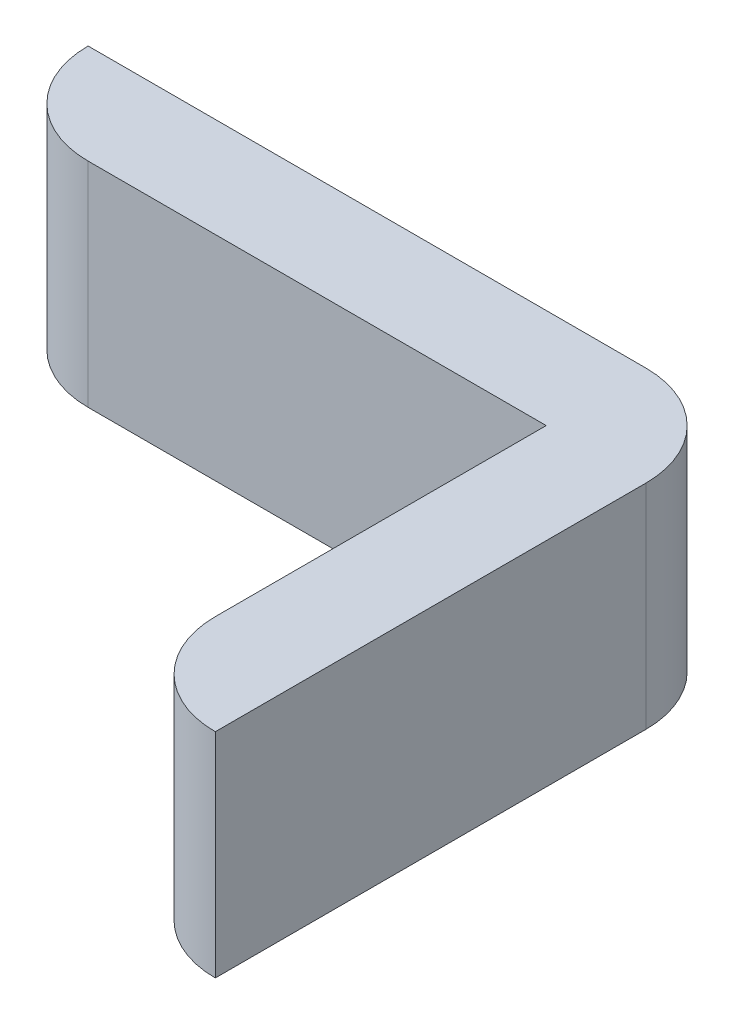
ISO-10303-21;
HEADER;
FILE_DESCRIPTION(('STEP AP214'),'2;1');
FILE_NAME('part.step','',(''),(''),'','','');
FILE_SCHEMA(('AUTOMOTIVE_DESIGN { 1 0 10303 214 1 1 1 1 }'));
ENDSEC;
DATA;
#1=APPLICATION_CONTEXT('core data for automotive mechanical design processes');
#2=APPLICATION_PROTOCOL_DEFINITION('international standard','automotive_design',2000,#1);
#3=PRODUCT_CONTEXT('',#1,'mechanical');
#4=PRODUCT('Part','Part','',(#3));
#5=PRODUCT_RELATED_PRODUCT_CATEGORY('part','',(#4));
#6=PRODUCT_DEFINITION_FORMATION('','',#4);
#7=PRODUCT_DEFINITION_CONTEXT('part definition',#1,'design');
#8=PRODUCT_DEFINITION('design','',#6,#7);
#9=PRODUCT_DEFINITION_SHAPE('','',#8);
#10=(LENGTH_UNIT() NAMED_UNIT(*) SI_UNIT(.MILLI.,.METRE.));
#11=(NAMED_UNIT(*) PLANE_ANGLE_UNIT() SI_UNIT($,.RADIAN.));
#12=(NAMED_UNIT(*) SI_UNIT($,.STERADIAN.) SOLID_ANGLE_UNIT());
#13=UNCERTAINTY_MEASURE_WITH_UNIT(LENGTH_MEASURE(1.E-05),#10,'distance_accuracy_value','');
#14=(GEOMETRIC_REPRESENTATION_CONTEXT(3) GLOBAL_UNCERTAINTY_ASSIGNED_CONTEXT((#13)) GLOBAL_UNIT_ASSIGNED_CONTEXT((#10,
#11,#12)) REPRESENTATION_CONTEXT('',''));
#15=CARTESIAN_POINT('',(0.,0.,0.));
#16=DIRECTION('',(0.,0.,1.));
#17=DIRECTION('',(1.,0.,0.));
#18=AXIS2_PLACEMENT_3D('',#15,#16,#17);
#19=CARTESIAN_POINT('',(4.1275,-0.9025,1.33));
#20=DIRECTION('',(-1.,0.,0.));
#21=DIRECTION('',(0.,0.,1.));
#22=AXIS2_PLACEMENT_3D('',#19,#20,#21);
#23=PLANE('',#22);
#24=DIRECTION('',(0.,0.,-1.));
#25=VECTOR('',#24,1.);
#26=CARTESIAN_POINT('',(4.1275,-0.9025,0.));
#27=LINE('',#26,#25);
#28=CARTESIAN_POINT('',(4.1275,-0.9025,0.25));
#29=VERTEX_POINT('',#28);
#30=CARTESIAN_POINT('',(4.1275,-0.9025,1.33));
#31=VERTEX_POINT('',#30);
#32=EDGE_CURVE('E129',#29,#31,#27,.F.);
#33=ORIENTED_EDGE('',*,*,#32,.F.);
#34=DIRECTION('',(0.,-1.,0.));
#35=VECTOR('',#34,1.);
#36=CARTESIAN_POINT('',(4.1275,-0.9025,0.25));
#37=LINE('',#36,#35);
#38=CARTESIAN_POINT('',(4.1275,-0.3675,0.25));
#39=VERTEX_POINT('',#38);
#40=EDGE_CURVE('E82',#39,#29,#37,.T.);
#41=ORIENTED_EDGE('',*,*,#40,.F.);
#42=DIRECTION('',(0.,0.,-1.));
#43=VECTOR('',#42,1.);
#44=CARTESIAN_POINT('',(4.1275,-0.3675,0.));
#45=LINE('',#44,#43);
#46=CARTESIAN_POINT('',(4.1275,-0.3675,1.33));
#47=VERTEX_POINT('',#46);
#48=EDGE_CURVE('E77',#39,#47,#45,.F.);
#49=ORIENTED_EDGE('',*,*,#48,.T.);
#50=DIRECTION('',(0.,-1.,0.));
#51=VECTOR('',#50,1.);
#52=CARTESIAN_POINT('',(4.1275,-0.9025,1.33));
#53=LINE('',#52,#51);
#54=EDGE_CURVE('E123',#31,#47,#53,.F.);
#55=ORIENTED_EDGE('',*,*,#54,.F.);
#56=EDGE_LOOP('',(#33,#41,#49,#55));
#57=FACE_BOUND('',#56,.T.);
#58=ADVANCED_FACE('F17',(#57),#23,.F.);
#59=CARTESIAN_POINT('',(4.1275,-0.9025,1.08));
#60=DIRECTION('',(0.,-1.,0.));
#61=DIRECTION('',(0.,0.,-1.));
#62=AXIS2_PLACEMENT_3D('',#59,#60,#61);
#63=CYLINDRICAL_SURFACE('',#62,0.25);
#64=CARTESIAN_POINT('',(4.1275,-0.3675,1.08));
#65=DIRECTION('',(0.,-1.,0.));
#66=DIRECTION('',(0.,0.,-1.));
#67=AXIS2_PLACEMENT_3D('',#64,#65,#66);
#68=CIRCLE('',#67,0.25);
#69=CARTESIAN_POINT('',(3.8775,-0.3675,1.08));
#70=VERTEX_POINT('',#69);
#71=EDGE_CURVE('E107',#47,#70,#68,.T.);
#72=ORIENTED_EDGE('',*,*,#71,.T.);
#73=DIRECTION('',(0.,1.,0.));
#74=VECTOR('',#73,1.);
#75=CARTESIAN_POINT('',(3.8775,-0.9025,1.08));
#76=LINE('',#75,#74);
#77=CARTESIAN_POINT('',(3.8775,-0.9025,1.08));
#78=VERTEX_POINT('',#77);
#79=EDGE_CURVE('E118',#70,#78,#76,.F.);
#80=ORIENTED_EDGE('',*,*,#79,.T.);
#81=CARTESIAN_POINT('',(4.1275,-0.9025,1.08));
#82=DIRECTION('',(0.,-1.,0.));
#83=DIRECTION('',(0.,0.,-1.));
#84=AXIS2_PLACEMENT_3D('',#81,#82,#83);
#85=CIRCLE('',#84,0.25);
#86=EDGE_CURVE('E126',#31,#78,#85,.T.);
#87=ORIENTED_EDGE('',*,*,#86,.F.);
#88=ORIENTED_EDGE('',*,*,#54,.T.);
#89=EDGE_LOOP('',(#72,#80,#87,#88));
#90=FACE_BOUND('',#89,.T.);
#91=ADVANCED_FACE('F133',(#90),#63,.T.);
#92=CARTESIAN_POINT('',(3.8775,-0.9025,0.25));
#93=DIRECTION('',(1.,0.,0.));
#94=DIRECTION('',(0.,0.,-1.));
#95=AXIS2_PLACEMENT_3D('',#92,#93,#94);
#96=PLANE('',#95);
#97=ORIENTED_EDGE('',*,*,#79,.F.);
#98=DIRECTION('',(0.,0.,-1.));
#99=VECTOR('',#98,1.);
#100=CARTESIAN_POINT('',(3.8775,-0.3675,0.));
#101=LINE('',#100,#99);
#102=CARTESIAN_POINT('',(3.8775,-0.3675,0.25));
#103=VERTEX_POINT('',#102);
#104=EDGE_CURVE('E102',#70,#103,#101,.T.);
#105=ORIENTED_EDGE('',*,*,#104,.T.);
#106=DIRECTION('',(0.,1.,0.));
#107=VECTOR('',#106,1.);
#108=CARTESIAN_POINT('',(3.8775,-0.9025,0.25));
#109=LINE('',#108,#107);
#110=CARTESIAN_POINT('',(3.8775,-0.9025,0.25));
#111=VERTEX_POINT('',#110);
#112=EDGE_CURVE('E115',#103,#111,#109,.F.);
#113=ORIENTED_EDGE('',*,*,#112,.T.);
#114=DIRECTION('',(0.,0.,-1.));
#115=VECTOR('',#114,1.);
#116=CARTESIAN_POINT('',(3.8775,-0.9025,0.));
#117=LINE('',#116,#115);
#118=EDGE_CURVE('E128',#78,#111,#117,.T.);
#119=ORIENTED_EDGE('',*,*,#118,.F.);
#120=EDGE_LOOP('',(#97,#105,#113,#119));
#121=FACE_BOUND('',#120,.T.);
#122=ADVANCED_FACE('F158',(#121),#96,.F.);
#123=CARTESIAN_POINT('',(2.7285,-0.9025,0.25));
#124=DIRECTION('',(0.,0.,-1.));
#125=DIRECTION('',(-1.,0.,0.));
#126=AXIS2_PLACEMENT_3D('',#123,#124,#125);
#127=PLANE('',#126);
#128=ORIENTED_EDGE('',*,*,#112,.F.);
#129=DIRECTION('',(1.,0.,0.));
#130=VECTOR('',#129,1.);
#131=CARTESIAN_POINT('',(2.4785,-0.3675,0.25));
#132=LINE('',#131,#130);
#133=CARTESIAN_POINT('',(2.7285,-0.3675,0.25));
#134=VERTEX_POINT('',#133);
#135=EDGE_CURVE('E98',#103,#134,#132,.F.);
#136=ORIENTED_EDGE('',*,*,#135,.T.);
#137=DIRECTION('',(0.,-1.,0.));
#138=VECTOR('',#137,1.);
#139=CARTESIAN_POINT('',(2.7285,-0.9025,0.25));
#140=LINE('',#139,#138);
#141=CARTESIAN_POINT('',(2.7285,-0.9025,0.25));
#142=VERTEX_POINT('',#141);
#143=EDGE_CURVE('E101',#142,#134,#140,.F.);
#144=ORIENTED_EDGE('',*,*,#143,.F.);
#145=DIRECTION('',(1.,0.,0.));
#146=VECTOR('',#145,1.);
#147=CARTESIAN_POINT('',(2.4785,-0.9025,0.25));
#148=LINE('',#147,#146);
#149=EDGE_CURVE('E94',#111,#142,#148,.F.);
#150=ORIENTED_EDGE('',*,*,#149,.F.);
#151=EDGE_LOOP('',(#128,#136,#144,#150));
#152=FACE_BOUND('',#151,.T.);
#153=ADVANCED_FACE('F156',(#152),#127,.F.);
#154=CARTESIAN_POINT('',(3.8775,-0.9025,0.25));
#155=DIRECTION('',(0.,-1.,0.));
#156=DIRECTION('',(0.,0.,-1.));
#157=AXIS2_PLACEMENT_3D('',#154,#155,#156);
#158=CYLINDRICAL_SURFACE('',#157,0.25);
#159=CARTESIAN_POINT('',(3.8775,-0.3675,0.25));
#160=DIRECTION('',(0.,-1.,0.));
#161=DIRECTION('',(0.,0.,-1.));
#162=AXIS2_PLACEMENT_3D('',#159,#160,#161);
#163=CIRCLE('',#162,0.25);
#164=CARTESIAN_POINT('',(3.8775,-0.3675,0.));
#165=VERTEX_POINT('',#164);
#166=EDGE_CURVE('E20',#165,#39,#163,.T.);
#167=ORIENTED_EDGE('',*,*,#166,.T.);
#168=ORIENTED_EDGE('',*,*,#40,.T.);
#169=CARTESIAN_POINT('',(3.8775,-0.9025,0.25));
#170=DIRECTION('',(0.,-1.,0.));
#171=DIRECTION('',(0.,0.,-1.));
#172=AXIS2_PLACEMENT_3D('',#169,#170,#171);
#173=CIRCLE('',#172,0.25);
#174=CARTESIAN_POINT('',(3.8775,-0.9025,0.));
#175=VERTEX_POINT('',#174);
#176=EDGE_CURVE('E92',#175,#29,#173,.T.);
#177=ORIENTED_EDGE('',*,*,#176,.F.);
#178=DIRECTION('',(0.,1.,0.));
#179=VECTOR('',#178,1.);
#180=CARTESIAN_POINT('',(3.8775,-0.9025,0.));
#181=LINE('',#180,#179);
#182=EDGE_CURVE('E86',#175,#165,#181,.T.);
#183=ORIENTED_EDGE('',*,*,#182,.T.);
#184=EDGE_LOOP('',(#167,#168,#177,#183));
#185=FACE_BOUND('',#184,.T.);
#186=ADVANCED_FACE('F90',(#185),#158,.T.);
#187=CARTESIAN_POINT('',(2.4785,-0.3675,0.));
#188=DIRECTION('',(0.,-1.,0.));
#189=DIRECTION('',(0.,0.,-1.));
#190=AXIS2_PLACEMENT_3D('',#187,#188,#189);
#191=PLANE('',#190);
#192=ORIENTED_EDGE('',*,*,#135,.F.);
#193=ORIENTED_EDGE('',*,*,#104,.F.);
#194=ORIENTED_EDGE('',*,*,#71,.F.);
#195=ORIENTED_EDGE('',*,*,#48,.F.);
#196=ORIENTED_EDGE('',*,*,#166,.F.);
#197=DIRECTION('',(1.,0.,0.));
#198=VECTOR('',#197,1.);
#199=CARTESIAN_POINT('',(3.8775,-0.3675,0.));
#200=LINE('',#199,#198);
#201=CARTESIAN_POINT('',(2.4785,-0.3675,0.));
#202=VERTEX_POINT('',#201);
#203=EDGE_CURVE('E74',#165,#202,#200,.F.);
#204=ORIENTED_EDGE('',*,*,#203,.T.);
#205=CARTESIAN_POINT('',(2.7285,-0.3675,0.));
#206=DIRECTION('',(0.,-1.,0.));
#207=DIRECTION('',(0.,0.,-1.));
#208=AXIS2_PLACEMENT_3D('',#205,#206,#207);
#209=CIRCLE('',#208,0.25);
#210=EDGE_CURVE('E114',#134,#202,#209,.T.);
#211=ORIENTED_EDGE('',*,*,#210,.F.);
#212=EDGE_LOOP('',(#192,#193,#194,#195,#196,#204,#211));
#213=FACE_BOUND('',#212,.T.);
#214=ADVANCED_FACE('F72',(#213),#191,.F.);
#215=CARTESIAN_POINT('',(2.7285,-0.9025,0.));
#216=DIRECTION('',(0.,-1.,0.));
#217=DIRECTION('',(0.,0.,-1.));
#218=AXIS2_PLACEMENT_3D('',#215,#216,#217);
#219=CYLINDRICAL_SURFACE('',#218,0.25);
#220=ORIENTED_EDGE('',*,*,#210,.T.);
#221=DIRECTION('',(0.,1.,0.));
#222=VECTOR('',#221,1.);
#223=CARTESIAN_POINT('',(2.4785,-0.9025,0.));
#224=LINE('',#223,#222);
#225=CARTESIAN_POINT('',(2.4785,-0.9025,0.));
#226=VERTEX_POINT('',#225);
#227=EDGE_CURVE('E26',#202,#226,#224,.F.);
#228=ORIENTED_EDGE('',*,*,#227,.T.);
#229=CARTESIAN_POINT('',(2.7285,-0.9025,0.));
#230=DIRECTION('',(0.,-1.,0.));
#231=DIRECTION('',(0.,0.,-1.));
#232=AXIS2_PLACEMENT_3D('',#229,#230,#231);
#233=CIRCLE('',#232,0.25);
#234=EDGE_CURVE('E34',#142,#226,#233,.T.);
#235=ORIENTED_EDGE('',*,*,#234,.F.);
#236=ORIENTED_EDGE('',*,*,#143,.T.);
#237=EDGE_LOOP('',(#220,#228,#235,#236));
#238=FACE_BOUND('',#237,.T.);
#239=ADVANCED_FACE('F141',(#238),#219,.T.);
#240=CARTESIAN_POINT('',(2.4785,-0.9025,0.));
#241=DIRECTION('',(0.,-1.,0.));
#242=DIRECTION('',(0.,0.,-1.));
#243=AXIS2_PLACEMENT_3D('',#240,#241,#242);
#244=PLANE('',#243);
#245=ORIENTED_EDGE('',*,*,#149,.T.);
#246=ORIENTED_EDGE('',*,*,#234,.T.);
#247=DIRECTION('',(1.,0.,0.));
#248=VECTOR('',#247,1.);
#249=CARTESIAN_POINT('',(3.8775,-0.9025,0.));
#250=LINE('',#249,#248);
#251=EDGE_CURVE('E11',#226,#175,#250,.T.);
#252=ORIENTED_EDGE('',*,*,#251,.T.);
#253=ORIENTED_EDGE('',*,*,#176,.T.);
#254=ORIENTED_EDGE('',*,*,#32,.T.);
#255=ORIENTED_EDGE('',*,*,#86,.T.);
#256=ORIENTED_EDGE('',*,*,#118,.T.);
#257=EDGE_LOOP('',(#245,#246,#252,#253,#254,#255,#256));
#258=FACE_BOUND('',#257,.T.);
#259=ADVANCED_FACE('F139',(#258),#244,.T.);
#260=CARTESIAN_POINT('',(3.8775,-0.9025,0.));
#261=DIRECTION('',(0.,0.,1.));
#262=DIRECTION('',(1.,0.,0.));
#263=AXIS2_PLACEMENT_3D('',#260,#261,#262);
#264=PLANE('',#263);
#265=ORIENTED_EDGE('',*,*,#227,.F.);
#266=ORIENTED_EDGE('',*,*,#203,.F.);
#267=ORIENTED_EDGE('',*,*,#182,.F.);
#268=ORIENTED_EDGE('',*,*,#251,.F.);
#269=EDGE_LOOP('',(#265,#266,#267,#268));
#270=FACE_BOUND('',#269,.T.);
#271=ADVANCED_FACE('F85',(#270),#264,.F.);
#272=CLOSED_SHELL('',(#58,#91,#122,#153,#186,#214,#239,#259,#271));
#273=MANIFOLD_SOLID_BREP('B1',#272);
#274=ADVANCED_BREP_SHAPE_REPRESENTATION('',(#18,#273),#14);
#275=SHAPE_DEFINITION_REPRESENTATION(#9,#274);
ENDSEC;
END-ISO-10303-21;
